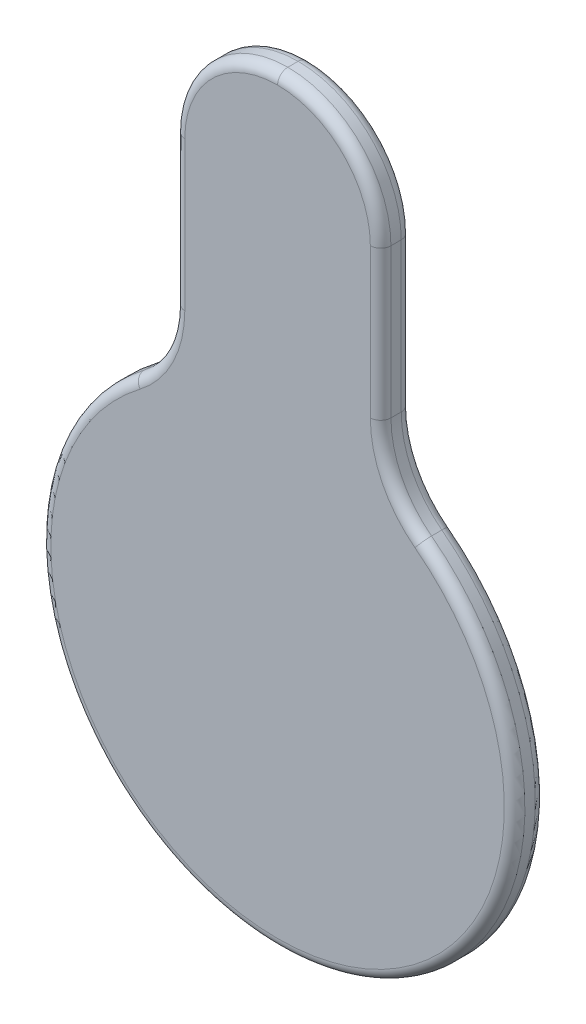
ISO-10303-21;
HEADER;
FILE_DESCRIPTION(('STEP AP214'),'2;1');
FILE_NAME('part.step','',(''),(''),'','','');
FILE_SCHEMA(('AUTOMOTIVE_DESIGN { 1 0 10303 214 1 1 1 1 }'));
ENDSEC;
DATA;
#1=APPLICATION_CONTEXT('core data for automotive mechanical design processes');
#2=APPLICATION_PROTOCOL_DEFINITION('international standard','automotive_design',2000,#1);
#3=PRODUCT_CONTEXT('',#1,'mechanical');
#4=PRODUCT('Part','Part','',(#3));
#5=PRODUCT_RELATED_PRODUCT_CATEGORY('part','',(#4));
#6=PRODUCT_DEFINITION_FORMATION('','',#4);
#7=PRODUCT_DEFINITION_CONTEXT('part definition',#1,'design');
#8=PRODUCT_DEFINITION('design','',#6,#7);
#9=PRODUCT_DEFINITION_SHAPE('','',#8);
#10=(LENGTH_UNIT() NAMED_UNIT(*) SI_UNIT(.MILLI.,.METRE.));
#11=(NAMED_UNIT(*) PLANE_ANGLE_UNIT() SI_UNIT($,.RADIAN.));
#12=(NAMED_UNIT(*) SI_UNIT($,.STERADIAN.) SOLID_ANGLE_UNIT());
#13=UNCERTAINTY_MEASURE_WITH_UNIT(LENGTH_MEASURE(1.E-05),#10,'distance_accuracy_value','');
#14=(GEOMETRIC_REPRESENTATION_CONTEXT(3) GLOBAL_UNCERTAINTY_ASSIGNED_CONTEXT((#13)) GLOBAL_UNIT_ASSIGNED_CONTEXT((#10,
#11,#12)) REPRESENTATION_CONTEXT('',''));
#15=CARTESIAN_POINT('',(0.,0.,0.));
#16=DIRECTION('',(0.,0.,1.));
#17=DIRECTION('',(1.,0.,0.));
#18=AXIS2_PLACEMENT_3D('',#15,#16,#17);
#19=CARTESIAN_POINT('',(0.,0.,7.62));
#20=DIRECTION('',(0.,0.,-1.));
#21=DIRECTION('',(-1.,0.,0.));
#22=AXIS2_PLACEMENT_3D('',#19,#20,#21);
#23=CYLINDRICAL_SURFACE('',#22,58.42);
#24=DIRECTION('',(0.,0.,-1.));
#25=VECTOR('',#24,1.);
#26=CARTESIAN_POINT('',(-35.4060606060606,46.4683469940557,7.62));
#27=LINE('',#26,#25);
#28=CARTESIAN_POINT('',(-35.4060606060606,46.4683469940557,5.08));
#29=VERTEX_POINT('',#28);
#30=CARTESIAN_POINT('',(-35.4060606060606,46.4683469940557,2.54));
#31=VERTEX_POINT('',#30);
#32=EDGE_CURVE('E320',#29,#31,#27,.T.);
#33=ORIENTED_EDGE('',*,*,#32,.T.);
#34=CARTESIAN_POINT('',(0.,0.,2.54));
#35=DIRECTION('',(0.,0.,1.));
#36=DIRECTION('',(1.,0.,0.));
#37=AXIS2_PLACEMENT_3D('',#34,#35,#36);
#38=CIRCLE('',#37,58.42);
#39=CARTESIAN_POINT('',(35.4060606060606,46.4683469940557,2.54));
#40=VERTEX_POINT('',#39);
#41=EDGE_CURVE('E11',#31,#40,#38,.T.);
#42=ORIENTED_EDGE('',*,*,#41,.T.);
#43=DIRECTION('',(0.,0.,-1.));
#44=VECTOR('',#43,1.);
#45=CARTESIAN_POINT('',(35.4060606060606,46.4683469940557,7.62));
#46=LINE('',#45,#44);
#47=CARTESIAN_POINT('',(35.4060606060606,46.4683469940557,5.08));
#48=VERTEX_POINT('',#47);
#49=EDGE_CURVE('E176',#40,#48,#46,.F.);
#50=ORIENTED_EDGE('',*,*,#49,.T.);
#51=CARTESIAN_POINT('',(0.,0.,5.08));
#52=DIRECTION('',(0.,0.,1.));
#53=DIRECTION('',(1.,0.,0.));
#54=AXIS2_PLACEMENT_3D('',#51,#52,#53);
#55=CIRCLE('',#54,58.42);
#56=EDGE_CURVE('E51',#48,#29,#55,.F.);
#57=ORIENTED_EDGE('',*,*,#56,.T.);
#58=EDGE_LOOP('',(#33,#42,#50,#57));
#59=FACE_BOUND('',#58,.T.);
#60=ADVANCED_FACE('F41',(#59),#23,.T.);
#61=CARTESIAN_POINT('',(25.4,0.,7.62));
#62=DIRECTION('',(1.,0.,0.));
#63=DIRECTION('',(0.,1.,0.));
#64=AXIS2_PLACEMENT_3D('',#61,#62,#63);
#65=PLANE('',#64);
#66=DIRECTION('',(0.,0.,-1.));
#67=VECTOR('',#66,1.);
#68=CARTESIAN_POINT('',(25.4,66.671976121906,7.62));
#69=LINE('',#68,#67);
#70=CARTESIAN_POINT('',(25.4,66.671976121906,5.08));
#71=VERTEX_POINT('',#70);
#72=CARTESIAN_POINT('',(25.4,66.671976121906,2.54));
#73=VERTEX_POINT('',#72);
#74=EDGE_CURVE('E328',#71,#73,#69,.T.);
#75=ORIENTED_EDGE('',*,*,#74,.T.);
#76=DIRECTION('',(0.,-1.,0.));
#77=VECTOR('',#76,1.);
#78=CARTESIAN_POINT('',(25.4,103.409280550108,2.54));
#79=LINE('',#78,#77);
#80=CARTESIAN_POINT('',(25.4,103.409280550108,2.54));
#81=VERTEX_POINT('',#80);
#82=EDGE_CURVE('E223',#73,#81,#79,.F.);
#83=ORIENTED_EDGE('',*,*,#82,.T.);
#84=DIRECTION('',(0.,0.,-1.));
#85=VECTOR('',#84,1.);
#86=CARTESIAN_POINT('',(25.4,103.409280550108,7.62));
#87=LINE('',#86,#85);
#88=CARTESIAN_POINT('',(25.4,103.409280550108,5.08));
#89=VERTEX_POINT('',#88);
#90=EDGE_CURVE('E348',#81,#89,#87,.F.);
#91=ORIENTED_EDGE('',*,*,#90,.T.);
#92=DIRECTION('',(0.,-1.,0.));
#93=VECTOR('',#92,1.);
#94=CARTESIAN_POINT('',(25.4,0.,5.08));
#95=LINE('',#94,#93);
#96=EDGE_CURVE('E220',#89,#71,#95,.T.);
#97=ORIENTED_EDGE('',*,*,#96,.T.);
#98=EDGE_LOOP('',(#75,#83,#91,#97));
#99=FACE_BOUND('',#98,.T.);
#100=ADVANCED_FACE('F359',(#99),#65,.T.);
#101=CARTESIAN_POINT('',(-25.4,0.,7.62));
#102=DIRECTION('',(1.,0.,0.));
#103=DIRECTION('',(0.,1.,0.));
#104=AXIS2_PLACEMENT_3D('',#101,#102,#103);
#105=PLANE('',#104);
#106=DIRECTION('',(0.,0.,-1.));
#107=VECTOR('',#106,1.);
#108=CARTESIAN_POINT('',(-25.4,103.409280550108,7.62));
#109=LINE('',#108,#107);
#110=CARTESIAN_POINT('',(-25.4,103.409280550108,5.08));
#111=VERTEX_POINT('',#110);
#112=CARTESIAN_POINT('',(-25.4,103.409280550108,2.54));
#113=VERTEX_POINT('',#112);
#114=EDGE_CURVE('E340',#111,#113,#109,.T.);
#115=ORIENTED_EDGE('',*,*,#114,.T.);
#116=DIRECTION('',(0.,-1.,0.));
#117=VECTOR('',#116,1.);
#118=CARTESIAN_POINT('',(-25.4,0.,2.54));
#119=LINE('',#118,#117);
#120=CARTESIAN_POINT('',(-25.4,66.671976121906,2.54));
#121=VERTEX_POINT('',#120);
#122=EDGE_CURVE('E205',#113,#121,#119,.T.);
#123=ORIENTED_EDGE('',*,*,#122,.T.);
#124=DIRECTION('',(0.,0.,1.));
#125=VECTOR('',#124,1.);
#126=CARTESIAN_POINT('',(-25.4,66.671976121906,7.62));
#127=LINE('',#126,#125);
#128=CARTESIAN_POINT('',(-25.4,66.671976121906,5.08));
#129=VERTEX_POINT('',#128);
#130=EDGE_CURVE('E172',#121,#129,#127,.T.);
#131=ORIENTED_EDGE('',*,*,#130,.T.);
#132=DIRECTION('',(0.,-1.,0.));
#133=VECTOR('',#132,1.);
#134=CARTESIAN_POINT('',(-25.4,103.409280550108,5.08));
#135=LINE('',#134,#133);
#136=EDGE_CURVE('E202',#129,#111,#135,.F.);
#137=ORIENTED_EDGE('',*,*,#136,.T.);
#138=EDGE_LOOP('',(#115,#123,#131,#137));
#139=FACE_BOUND('',#138,.T.);
#140=ADVANCED_FACE('F339',(#139),#105,.F.);
#141=CARTESIAN_POINT('',(0.,0.,7.62));
#142=DIRECTION('',(0.,0.,1.));
#143=DIRECTION('',(1.,0.,0.));
#144=AXIS2_PLACEMENT_3D('',#141,#142,#143);
#145=PLANE('',#144);
#146=DIRECTION('',(0.,-1.,0.));
#147=VECTOR('',#146,1.);
#148=CARTESIAN_POINT('',(-22.86,66.671976121906,7.62));
#149=LINE('',#148,#147);
#150=CARTESIAN_POINT('',(-22.86,103.409280550108,7.62));
#151=VERTEX_POINT('',#150);
#152=CARTESIAN_POINT('',(-22.86,66.671976121906,7.62));
#153=VERTEX_POINT('',#152);
#154=EDGE_CURVE('E59',#151,#153,#149,.T.);
#155=ORIENTED_EDGE('',*,*,#154,.T.);
#156=CARTESIAN_POINT('',(-50.8,66.671976121906,7.62));
#157=DIRECTION('',(0.,0.,1.));
#158=DIRECTION('',(1.,0.,0.));
#159=AXIS2_PLACEMENT_3D('',#156,#157,#158);
#160=CIRCLE('',#159,27.94);
#161=CARTESIAN_POINT('',(-33.8666666666667,44.4479840812706,7.62));
#162=VERTEX_POINT('',#161);
#163=EDGE_CURVE('E247',#153,#162,#160,.F.);
#164=ORIENTED_EDGE('',*,*,#163,.T.);
#165=CARTESIAN_POINT('',(0.,0.,7.62));
#166=DIRECTION('',(0.,0.,1.));
#167=DIRECTION('',(1.,0.,0.));
#168=AXIS2_PLACEMENT_3D('',#165,#166,#167);
#169=CIRCLE('',#168,55.88);
#170=CARTESIAN_POINT('',(33.8666666666667,44.4479840812706,7.62));
#171=VERTEX_POINT('',#170);
#172=EDGE_CURVE('E231',#162,#171,#169,.T.);
#173=ORIENTED_EDGE('',*,*,#172,.T.);
#174=CARTESIAN_POINT('',(50.8,66.671976121906,7.62));
#175=DIRECTION('',(0.,0.,1.));
#176=DIRECTION('',(1.,0.,0.));
#177=AXIS2_PLACEMENT_3D('',#174,#175,#176);
#178=CIRCLE('',#177,27.94);
#179=CARTESIAN_POINT('',(22.86,66.671976121906,7.62));
#180=VERTEX_POINT('',#179);
#181=EDGE_CURVE('E234',#171,#180,#178,.F.);
#182=ORIENTED_EDGE('',*,*,#181,.T.);
#183=DIRECTION('',(0.,-1.,0.));
#184=VECTOR('',#183,1.);
#185=CARTESIAN_POINT('',(22.86,0.,7.62));
#186=LINE('',#185,#184);
#187=CARTESIAN_POINT('',(22.86,103.409280550108,7.62));
#188=VERTEX_POINT('',#187);
#189=EDGE_CURVE('E237',#180,#188,#186,.F.);
#190=ORIENTED_EDGE('',*,*,#189,.T.);
#191=CARTESIAN_POINT('',(0.,103.409280550108,7.62));
#192=DIRECTION('',(0.,0.,1.));
#193=DIRECTION('',(1.,0.,0.));
#194=AXIS2_PLACEMENT_3D('',#191,#192,#193);
#195=CIRCLE('',#194,22.86);
#196=CARTESIAN_POINT('',(0.,126.269280550108,7.62));
#197=VERTEX_POINT('',#196);
#198=EDGE_CURVE('E240',#188,#197,#195,.T.);
#199=ORIENTED_EDGE('',*,*,#198,.T.);
#200=CARTESIAN_POINT('',(0.,103.409280550108,7.62));
#201=DIRECTION('',(0.,0.,1.));
#202=DIRECTION('',(1.,0.,0.));
#203=AXIS2_PLACEMENT_3D('',#200,#201,#202);
#204=CIRCLE('',#203,22.86);
#205=EDGE_CURVE('E64',#197,#151,#204,.T.);
#206=ORIENTED_EDGE('',*,*,#205,.T.);
#207=EDGE_LOOP('',(#155,#164,#173,#182,#190,#199,#206));
#208=FACE_BOUND('',#207,.T.);
#209=ADVANCED_FACE('F305',(#208),#145,.T.);
#210=CARTESIAN_POINT('',(0.,0.,0.));
#211=DIRECTION('',(0.,0.,1.));
#212=DIRECTION('',(1.,0.,0.));
#213=AXIS2_PLACEMENT_3D('',#210,#211,#212);
#214=PLANE('',#213);
#215=CARTESIAN_POINT('',(0.,0.,0.));
#216=DIRECTION('',(0.,0.,1.));
#217=DIRECTION('',(1.,0.,0.));
#218=AXIS2_PLACEMENT_3D('',#215,#216,#217);
#219=CIRCLE('',#218,55.88);
#220=CARTESIAN_POINT('',(33.8666666666667,44.4479840812706,0.));
#221=VERTEX_POINT('',#220);
#222=CARTESIAN_POINT('',(-33.8666666666667,44.4479840812706,0.));
#223=VERTEX_POINT('',#222);
#224=EDGE_CURVE('E148',#221,#223,#219,.F.);
#225=ORIENTED_EDGE('',*,*,#224,.T.);
#226=CARTESIAN_POINT('',(-50.8,66.671976121906,0.));
#227=DIRECTION('',(0.,0.,1.));
#228=DIRECTION('',(1.,0.,0.));
#229=AXIS2_PLACEMENT_3D('',#226,#227,#228);
#230=CIRCLE('',#229,27.94);
#231=CARTESIAN_POINT('',(-22.86,66.671976121906,0.));
#232=VERTEX_POINT('',#231);
#233=EDGE_CURVE('E191',#223,#232,#230,.T.);
#234=ORIENTED_EDGE('',*,*,#233,.T.);
#235=DIRECTION('',(0.,-1.,0.));
#236=VECTOR('',#235,1.);
#237=CARTESIAN_POINT('',(-22.86,0.,0.));
#238=LINE('',#237,#236);
#239=CARTESIAN_POINT('',(-22.86,103.409280550108,0.));
#240=VERTEX_POINT('',#239);
#241=EDGE_CURVE('E188',#232,#240,#238,.F.);
#242=ORIENTED_EDGE('',*,*,#241,.T.);
#243=CARTESIAN_POINT('',(0.,103.409280550108,0.));
#244=DIRECTION('',(0.,0.,1.));
#245=DIRECTION('',(1.,0.,0.));
#246=AXIS2_PLACEMENT_3D('',#243,#244,#245);
#247=CIRCLE('',#246,22.86);
#248=CARTESIAN_POINT('',(0.,126.269280550108,0.));
#249=VERTEX_POINT('',#248);
#250=EDGE_CURVE('E185',#240,#249,#247,.F.);
#251=ORIENTED_EDGE('',*,*,#250,.T.);
#252=CARTESIAN_POINT('',(0.,103.409280550108,0.));
#253=DIRECTION('',(0.,0.,1.));
#254=DIRECTION('',(1.,0.,0.));
#255=AXIS2_PLACEMENT_3D('',#252,#253,#254);
#256=CIRCLE('',#255,22.86);
#257=CARTESIAN_POINT('',(22.86,103.409280550108,0.));
#258=VERTEX_POINT('',#257);
#259=EDGE_CURVE('E182',#249,#258,#256,.F.);
#260=ORIENTED_EDGE('',*,*,#259,.T.);
#261=DIRECTION('',(0.,-1.,0.));
#262=VECTOR('',#261,1.);
#263=CARTESIAN_POINT('',(22.86,66.671976121906,0.));
#264=LINE('',#263,#262);
#265=CARTESIAN_POINT('',(22.86,66.671976121906,0.));
#266=VERTEX_POINT('',#265);
#267=EDGE_CURVE('E151',#258,#266,#264,.T.);
#268=ORIENTED_EDGE('',*,*,#267,.T.);
#269=CARTESIAN_POINT('',(50.8,66.671976121906,0.));
#270=DIRECTION('',(0.,0.,1.));
#271=DIRECTION('',(1.,0.,0.));
#272=AXIS2_PLACEMENT_3D('',#269,#270,#271);
#273=CIRCLE('',#272,27.94);
#274=EDGE_CURVE('E143',#266,#221,#273,.T.);
#275=ORIENTED_EDGE('',*,*,#274,.T.);
#276=EDGE_LOOP('',(#225,#234,#242,#251,#260,#268,#275));
#277=FACE_BOUND('',#276,.T.);
#278=ADVANCED_FACE('F145',(#277),#214,.F.);
#279=CARTESIAN_POINT('',(0.,103.409280550108,7.62));
#280=DIRECTION('',(0.,0.,1.));
#281=DIRECTION('',(1.,0.,0.));
#282=AXIS2_PLACEMENT_3D('',#279,#280,#281);
#283=CYLINDRICAL_SURFACE('',#282,25.4);
#284=ORIENTED_EDGE('',*,*,#90,.F.);
#285=CARTESIAN_POINT('',(0.,103.409280550108,2.54));
#286=DIRECTION('',(0.,0.,1.));
#287=DIRECTION('',(1.,0.,0.));
#288=AXIS2_PLACEMENT_3D('',#285,#286,#287);
#289=CIRCLE('',#288,25.4);
#290=CARTESIAN_POINT('',(0.,128.809280550108,2.54));
#291=VERTEX_POINT('',#290);
#292=EDGE_CURVE('E217',#81,#291,#289,.T.);
#293=ORIENTED_EDGE('',*,*,#292,.T.);
#294=DIRECTION('',(0.,0.,-1.));
#295=VECTOR('',#294,1.);
#296=CARTESIAN_POINT('',(0.,128.809280550108,0.));
#297=LINE('',#296,#295);
#298=CARTESIAN_POINT('',(0.,128.809280550108,5.08));
#299=VERTEX_POINT('',#298);
#300=EDGE_CURVE('E270',#299,#291,#297,.T.);
#301=ORIENTED_EDGE('',*,*,#300,.F.);
#302=CARTESIAN_POINT('',(0.,103.409280550108,5.08));
#303=DIRECTION('',(0.,0.,1.));
#304=DIRECTION('',(1.,0.,0.));
#305=AXIS2_PLACEMENT_3D('',#302,#303,#304);
#306=CIRCLE('',#305,25.4);
#307=EDGE_CURVE('E214',#299,#89,#306,.F.);
#308=ORIENTED_EDGE('',*,*,#307,.T.);
#309=EDGE_LOOP('',(#284,#293,#301,#308));
#310=FACE_BOUND('',#309,.T.);
#311=ADVANCED_FACE('F371',(#310),#283,.T.);
#312=CARTESIAN_POINT('',(0.,103.409280550108,7.62));
#313=DIRECTION('',(0.,0.,-1.));
#314=DIRECTION('',(-1.,0.,0.));
#315=AXIS2_PLACEMENT_3D('',#312,#313,#314);
#316=CYLINDRICAL_SURFACE('',#315,25.4);
#317=ORIENTED_EDGE('',*,*,#300,.T.);
#318=CARTESIAN_POINT('',(0.,103.409280550108,2.54));
#319=DIRECTION('',(0.,0.,1.));
#320=DIRECTION('',(1.,0.,0.));
#321=AXIS2_PLACEMENT_3D('',#318,#319,#320);
#322=CIRCLE('',#321,25.4);
#323=EDGE_CURVE('E211',#291,#113,#322,.T.);
#324=ORIENTED_EDGE('',*,*,#323,.T.);
#325=ORIENTED_EDGE('',*,*,#114,.F.);
#326=CARTESIAN_POINT('',(0.,103.409280550108,5.08));
#327=DIRECTION('',(0.,0.,1.));
#328=DIRECTION('',(1.,0.,0.));
#329=AXIS2_PLACEMENT_3D('',#326,#327,#328);
#330=CIRCLE('',#329,25.4);
#331=EDGE_CURVE('E208',#111,#299,#330,.F.);
#332=ORIENTED_EDGE('',*,*,#331,.T.);
#333=EDGE_LOOP('',(#317,#324,#325,#332));
#334=FACE_BOUND('',#333,.T.);
#335=ADVANCED_FACE('F344',(#334),#316,.T.);
#336=CARTESIAN_POINT('',(50.8,66.671976121906,7.62));
#337=DIRECTION('',(0.,0.,-1.));
#338=DIRECTION('',(-1.,0.,0.));
#339=AXIS2_PLACEMENT_3D('',#336,#337,#338);
#340=CYLINDRICAL_SURFACE('',#339,25.4);
#341=ORIENTED_EDGE('',*,*,#49,.F.);
#342=CARTESIAN_POINT('',(50.8,66.671976121906,2.54));
#343=DIRECTION('',(0.,0.,1.));
#344=DIRECTION('',(1.,0.,0.));
#345=AXIS2_PLACEMENT_3D('',#342,#343,#344);
#346=CIRCLE('',#345,25.4);
#347=EDGE_CURVE('E161',#40,#73,#346,.F.);
#348=ORIENTED_EDGE('',*,*,#347,.T.);
#349=ORIENTED_EDGE('',*,*,#74,.F.);
#350=CARTESIAN_POINT('',(50.8,66.671976121906,5.08));
#351=DIRECTION('',(0.,0.,1.));
#352=DIRECTION('',(1.,0.,0.));
#353=AXIS2_PLACEMENT_3D('',#350,#351,#352);
#354=CIRCLE('',#353,25.4);
#355=EDGE_CURVE('E226',#71,#48,#354,.T.);
#356=ORIENTED_EDGE('',*,*,#355,.T.);
#357=EDGE_LOOP('',(#341,#348,#349,#356));
#358=FACE_BOUND('',#357,.T.);
#359=ADVANCED_FACE('F370',(#358),#340,.F.);
#360=CARTESIAN_POINT('',(-50.8,66.671976121906,7.62));
#361=DIRECTION('',(0.,0.,-1.));
#362=DIRECTION('',(-1.,0.,0.));
#363=AXIS2_PLACEMENT_3D('',#360,#361,#362);
#364=CYLINDRICAL_SURFACE('',#363,25.4);
#365=ORIENTED_EDGE('',*,*,#130,.F.);
#366=CARTESIAN_POINT('',(-50.8,66.671976121906,2.54));
#367=DIRECTION('',(0.,0.,1.));
#368=DIRECTION('',(1.,0.,0.));
#369=AXIS2_PLACEMENT_3D('',#366,#367,#368);
#370=CIRCLE('',#369,25.4);
#371=EDGE_CURVE('E198',#121,#31,#370,.F.);
#372=ORIENTED_EDGE('',*,*,#371,.T.);
#373=ORIENTED_EDGE('',*,*,#32,.F.);
#374=CARTESIAN_POINT('',(-50.8,66.671976121906,5.08));
#375=DIRECTION('',(0.,0.,1.));
#376=DIRECTION('',(1.,0.,0.));
#377=AXIS2_PLACEMENT_3D('',#374,#375,#376);
#378=CIRCLE('',#377,25.4);
#379=EDGE_CURVE('E194',#29,#129,#378,.T.);
#380=ORIENTED_EDGE('',*,*,#379,.T.);
#381=EDGE_LOOP('',(#365,#372,#373,#380));
#382=FACE_BOUND('',#381,.T.);
#383=ADVANCED_FACE('F325',(#382),#364,.F.);
#384=CARTESIAN_POINT('',(22.86,0.,2.54));
#385=DIRECTION('',(0.,1.,0.));
#386=DIRECTION('',(-1.,0.,0.));
#387=AXIS2_PLACEMENT_3D('',#384,#385,#386);
#388=CYLINDRICAL_SURFACE('',#387,2.54);
#389=CARTESIAN_POINT('',(22.86,66.671976121906,2.54));
#390=DIRECTION('',(0.,-1.,0.));
#391=DIRECTION('',(0.,0.,-1.));
#392=AXIS2_PLACEMENT_3D('',#389,#390,#391);
#393=CIRCLE('',#392,2.54);
#394=EDGE_CURVE('E263',#266,#73,#393,.T.);
#395=ORIENTED_EDGE('',*,*,#394,.F.);
#396=ORIENTED_EDGE('',*,*,#267,.F.);
#397=CARTESIAN_POINT('',(22.86,103.409280550108,2.54));
#398=DIRECTION('',(0.,1.,0.));
#399=DIRECTION('',(0.,0.,1.));
#400=AXIS2_PLACEMENT_3D('',#397,#398,#399);
#401=CIRCLE('',#400,2.54);
#402=EDGE_CURVE('E266',#81,#258,#401,.T.);
#403=ORIENTED_EDGE('',*,*,#402,.F.);
#404=ORIENTED_EDGE('',*,*,#82,.F.);
#405=EDGE_LOOP('',(#395,#396,#403,#404));
#406=FACE_BOUND('',#405,.T.);
#407=ADVANCED_FACE('F380',(#406),#388,.T.);
#408=CARTESIAN_POINT('',(0.,103.409280550108,2.54));
#409=DIRECTION('',(0.,0.,1.));
#410=DIRECTION('',(1.,0.,0.));
#411=AXIS2_PLACEMENT_3D('',#408,#409,#410);
#412=TOROIDAL_SURFACE('',#411,22.86,2.54);
#413=ORIENTED_EDGE('',*,*,#402,.T.);
#414=ORIENTED_EDGE('',*,*,#259,.F.);
#415=CARTESIAN_POINT('',(0.,126.269280550108,2.54));
#416=DIRECTION('',(-1.,0.,0.));
#417=DIRECTION('',(0.,0.,1.));
#418=AXIS2_PLACEMENT_3D('',#415,#416,#417);
#419=CIRCLE('',#418,2.54);
#420=EDGE_CURVE('E165',#291,#249,#419,.T.);
#421=ORIENTED_EDGE('',*,*,#420,.F.);
#422=ORIENTED_EDGE('',*,*,#292,.F.);
#423=EDGE_LOOP('',(#413,#414,#421,#422));
#424=FACE_BOUND('',#423,.T.);
#425=ADVANCED_FACE('F397',(#424),#412,.T.);
#426=CARTESIAN_POINT('',(50.8,66.671976121906,2.54));
#427=DIRECTION('',(0.,0.,1.));
#428=DIRECTION('',(1.,0.,0.));
#429=AXIS2_PLACEMENT_3D('',#426,#427,#428);
#430=TOROIDAL_SURFACE('',#429,27.94,2.54);
#431=ORIENTED_EDGE('',*,*,#394,.T.);
#432=ORIENTED_EDGE('',*,*,#347,.F.);
#433=CARTESIAN_POINT('',(33.8666666666667,44.4479840812706,2.54));
#434=DIRECTION('',(0.795418469600406,-0.606060606060605,0.));
#435=DIRECTION('',(0.606060606060605,0.795418469600406,0.));
#436=AXIS2_PLACEMENT_3D('',#433,#434,#435);
#437=CIRCLE('',#436,2.54);
#438=EDGE_CURVE('E159',#221,#40,#437,.T.);
#439=ORIENTED_EDGE('',*,*,#438,.F.);
#440=ORIENTED_EDGE('',*,*,#274,.F.);
#441=EDGE_LOOP('',(#431,#432,#439,#440));
#442=FACE_BOUND('',#441,.T.);
#443=ADVANCED_FACE('F160',(#442),#430,.T.);
#444=CARTESIAN_POINT('',(0.,103.409280550108,2.54));
#445=DIRECTION('',(0.,0.,1.));
#446=DIRECTION('',(1.,0.,0.));
#447=AXIS2_PLACEMENT_3D('',#444,#445,#446);
#448=TOROIDAL_SURFACE('',#447,22.86,2.54);
#449=ORIENTED_EDGE('',*,*,#420,.T.);
#450=ORIENTED_EDGE('',*,*,#250,.F.);
#451=CARTESIAN_POINT('',(-22.86,103.409280550108,2.54));
#452=DIRECTION('',(0.,-1.,0.));
#453=DIRECTION('',(0.,0.,-1.));
#454=AXIS2_PLACEMENT_3D('',#451,#452,#453);
#455=CIRCLE('',#454,2.54);
#456=EDGE_CURVE('E166',#113,#240,#455,.T.);
#457=ORIENTED_EDGE('',*,*,#456,.F.);
#458=ORIENTED_EDGE('',*,*,#323,.F.);
#459=EDGE_LOOP('',(#449,#450,#457,#458));
#460=FACE_BOUND('',#459,.T.);
#461=ADVANCED_FACE('F391',(#460),#448,.T.);
#462=CARTESIAN_POINT('',(0.,0.,2.54));
#463=DIRECTION('',(0.,0.,1.));
#464=DIRECTION('',(1.,0.,0.));
#465=AXIS2_PLACEMENT_3D('',#462,#463,#464);
#466=TOROIDAL_SURFACE('',#465,55.88,2.54);
#467=ORIENTED_EDGE('',*,*,#438,.T.);
#468=ORIENTED_EDGE('',*,*,#41,.F.);
#469=CARTESIAN_POINT('',(-33.8666666666667,44.4479840812706,2.54));
#470=DIRECTION('',(0.795418469600407,0.606060606060604,0.));
#471=DIRECTION('',(-0.606060606060604,0.795418469600407,0.));
#472=AXIS2_PLACEMENT_3D('',#469,#470,#471);
#473=CIRCLE('',#472,2.54);
#474=EDGE_CURVE('E169',#223,#31,#473,.T.);
#475=ORIENTED_EDGE('',*,*,#474,.F.);
#476=ORIENTED_EDGE('',*,*,#224,.F.);
#477=EDGE_LOOP('',(#467,#468,#475,#476));
#478=FACE_BOUND('',#477,.T.);
#479=ADVANCED_FACE('F168',(#478),#466,.T.);
#480=CARTESIAN_POINT('',(-22.86,0.,2.54));
#481=DIRECTION('',(0.,-1.,0.));
#482=DIRECTION('',(1.,0.,0.));
#483=AXIS2_PLACEMENT_3D('',#480,#481,#482);
#484=CYLINDRICAL_SURFACE('',#483,2.54);
#485=ORIENTED_EDGE('',*,*,#456,.T.);
#486=ORIENTED_EDGE('',*,*,#241,.F.);
#487=CARTESIAN_POINT('',(-22.86,66.671976121906,2.54));
#488=DIRECTION('',(0.,-1.,0.));
#489=DIRECTION('',(0.,0.,-1.));
#490=AXIS2_PLACEMENT_3D('',#487,#488,#489);
#491=CIRCLE('',#490,2.54);
#492=EDGE_CURVE('E252',#121,#232,#491,.T.);
#493=ORIENTED_EDGE('',*,*,#492,.F.);
#494=ORIENTED_EDGE('',*,*,#122,.F.);
#495=EDGE_LOOP('',(#485,#486,#493,#494));
#496=FACE_BOUND('',#495,.T.);
#497=ADVANCED_FACE('F384',(#496),#484,.T.);
#498=CARTESIAN_POINT('',(-50.8,66.671976121906,2.54));
#499=DIRECTION('',(0.,0.,1.));
#500=DIRECTION('',(1.,0.,0.));
#501=AXIS2_PLACEMENT_3D('',#498,#499,#500);
#502=TOROIDAL_SURFACE('',#501,27.94,2.54);
#503=ORIENTED_EDGE('',*,*,#474,.T.);
#504=ORIENTED_EDGE('',*,*,#371,.F.);
#505=ORIENTED_EDGE('',*,*,#492,.T.);
#506=ORIENTED_EDGE('',*,*,#233,.F.);
#507=EDGE_LOOP('',(#503,#504,#505,#506));
#508=FACE_BOUND('',#507,.T.);
#509=ADVANCED_FACE('F381',(#508),#502,.T.);
#510=CARTESIAN_POINT('',(0.,103.409280550108,5.08));
#511=DIRECTION('',(0.,0.,1.));
#512=DIRECTION('',(1.,0.,0.));
#513=AXIS2_PLACEMENT_3D('',#510,#511,#512);
#514=TOROIDAL_SURFACE('',#513,22.86,2.54);
#515=CARTESIAN_POINT('',(0.,126.269280550108,5.08));
#516=DIRECTION('',(-1.,0.,0.));
#517=DIRECTION('',(0.,-1.,0.));
#518=AXIS2_PLACEMENT_3D('',#515,#516,#517);
#519=CIRCLE('',#518,2.54);
#520=EDGE_CURVE('E288',#197,#299,#519,.T.);
#521=ORIENTED_EDGE('',*,*,#520,.F.);
#522=ORIENTED_EDGE('',*,*,#198,.F.);
#523=CARTESIAN_POINT('',(22.86,103.409280550108,5.08));
#524=DIRECTION('',(0.,-1.,0.));
#525=DIRECTION('',(0.,0.,-1.));
#526=AXIS2_PLACEMENT_3D('',#523,#524,#525);
#527=CIRCLE('',#526,2.54);
#528=EDGE_CURVE('E45',#89,#188,#527,.T.);
#529=ORIENTED_EDGE('',*,*,#528,.F.);
#530=ORIENTED_EDGE('',*,*,#307,.F.);
#531=EDGE_LOOP('',(#521,#522,#529,#530));
#532=FACE_BOUND('',#531,.T.);
#533=ADVANCED_FACE('F43',(#532),#514,.T.);
#534=CARTESIAN_POINT('',(22.86,0.,5.08));
#535=DIRECTION('',(0.,-1.,0.));
#536=DIRECTION('',(1.,0.,0.));
#537=AXIS2_PLACEMENT_3D('',#534,#535,#536);
#538=CYLINDRICAL_SURFACE('',#537,2.54);
#539=ORIENTED_EDGE('',*,*,#528,.T.);
#540=ORIENTED_EDGE('',*,*,#189,.F.);
#541=CARTESIAN_POINT('',(22.86,66.671976121906,5.08));
#542=DIRECTION('',(0.,-1.,0.));
#543=DIRECTION('',(0.,0.,-1.));
#544=AXIS2_PLACEMENT_3D('',#541,#542,#543);
#545=CIRCLE('',#544,2.54);
#546=EDGE_CURVE('E285',#71,#180,#545,.T.);
#547=ORIENTED_EDGE('',*,*,#546,.F.);
#548=ORIENTED_EDGE('',*,*,#96,.F.);
#549=EDGE_LOOP('',(#539,#540,#547,#548));
#550=FACE_BOUND('',#549,.T.);
#551=ADVANCED_FACE('F300',(#550),#538,.T.);
#552=CARTESIAN_POINT('',(0.,103.409280550108,5.08));
#553=DIRECTION('',(0.,0.,1.));
#554=DIRECTION('',(1.,0.,0.));
#555=AXIS2_PLACEMENT_3D('',#552,#553,#554);
#556=TOROIDAL_SURFACE('',#555,22.86,2.54);
#557=ORIENTED_EDGE('',*,*,#520,.T.);
#558=ORIENTED_EDGE('',*,*,#331,.F.);
#559=CARTESIAN_POINT('',(-22.86,103.409280550108,5.08));
#560=DIRECTION('',(0.,-1.,0.));
#561=DIRECTION('',(0.,0.,-1.));
#562=AXIS2_PLACEMENT_3D('',#559,#560,#561);
#563=CIRCLE('',#562,2.54);
#564=EDGE_CURVE('E281',#151,#111,#563,.T.);
#565=ORIENTED_EDGE('',*,*,#564,.F.);
#566=ORIENTED_EDGE('',*,*,#205,.F.);
#567=EDGE_LOOP('',(#557,#558,#565,#566));
#568=FACE_BOUND('',#567,.T.);
#569=ADVANCED_FACE('F350',(#568),#556,.T.);
#570=CARTESIAN_POINT('',(50.8,66.671976121906,5.08));
#571=DIRECTION('',(0.,0.,1.));
#572=DIRECTION('',(1.,0.,0.));
#573=AXIS2_PLACEMENT_3D('',#570,#571,#572);
#574=TOROIDAL_SURFACE('',#573,27.94,2.54);
#575=ORIENTED_EDGE('',*,*,#546,.T.);
#576=ORIENTED_EDGE('',*,*,#181,.F.);
#577=CARTESIAN_POINT('',(33.8666666666666,44.4479840812706,5.08));
#578=DIRECTION('',(0.795418469600406,-0.606060606060605,0.));
#579=DIRECTION('',(0.606060606060605,0.795418469600406,0.));
#580=AXIS2_PLACEMENT_3D('',#577,#578,#579);
#581=CIRCLE('',#580,2.54);
#582=EDGE_CURVE('E277',#48,#171,#581,.T.);
#583=ORIENTED_EDGE('',*,*,#582,.F.);
#584=ORIENTED_EDGE('',*,*,#355,.F.);
#585=EDGE_LOOP('',(#575,#576,#583,#584));
#586=FACE_BOUND('',#585,.T.);
#587=ADVANCED_FACE('F310',(#586),#574,.T.);
#588=CARTESIAN_POINT('',(-22.86,0.,5.08));
#589=DIRECTION('',(0.,1.,0.));
#590=DIRECTION('',(-1.,0.,0.));
#591=AXIS2_PLACEMENT_3D('',#588,#589,#590);
#592=CYLINDRICAL_SURFACE('',#591,2.54);
#593=ORIENTED_EDGE('',*,*,#564,.T.);
#594=ORIENTED_EDGE('',*,*,#136,.F.);
#595=CARTESIAN_POINT('',(-22.86,66.671976121906,5.08));
#596=DIRECTION('',(0.,-1.,0.));
#597=DIRECTION('',(0.,0.,-1.));
#598=AXIS2_PLACEMENT_3D('',#595,#596,#597);
#599=CIRCLE('',#598,2.54);
#600=EDGE_CURVE('E274',#153,#129,#599,.T.);
#601=ORIENTED_EDGE('',*,*,#600,.F.);
#602=ORIENTED_EDGE('',*,*,#154,.F.);
#603=EDGE_LOOP('',(#593,#594,#601,#602));
#604=FACE_BOUND('',#603,.T.);
#605=ADVANCED_FACE('F335',(#604),#592,.T.);
#606=CARTESIAN_POINT('',(0.,0.,5.08));
#607=DIRECTION('',(0.,0.,1.));
#608=DIRECTION('',(1.,0.,0.));
#609=AXIS2_PLACEMENT_3D('',#606,#607,#608);
#610=TOROIDAL_SURFACE('',#609,55.88,2.54);
#611=ORIENTED_EDGE('',*,*,#582,.T.);
#612=ORIENTED_EDGE('',*,*,#172,.F.);
#613=CARTESIAN_POINT('',(-33.8666666666667,44.4479840812706,5.08));
#614=DIRECTION('',(0.795418469600406,0.606060606060605,0.));
#615=DIRECTION('',(-0.606060606060605,0.795418469600406,0.));
#616=AXIS2_PLACEMENT_3D('',#613,#614,#615);
#617=CIRCLE('',#616,2.54);
#618=EDGE_CURVE('E271',#29,#162,#617,.T.);
#619=ORIENTED_EDGE('',*,*,#618,.F.);
#620=ORIENTED_EDGE('',*,*,#56,.F.);
#621=EDGE_LOOP('',(#611,#612,#619,#620));
#622=FACE_BOUND('',#621,.T.);
#623=ADVANCED_FACE('F314',(#622),#610,.T.);
#624=CARTESIAN_POINT('',(-50.8,66.671976121906,5.08));
#625=DIRECTION('',(0.,0.,1.));
#626=DIRECTION('',(1.,0.,0.));
#627=AXIS2_PLACEMENT_3D('',#624,#625,#626);
#628=TOROIDAL_SURFACE('',#627,27.94,2.54);
#629=ORIENTED_EDGE('',*,*,#600,.T.);
#630=ORIENTED_EDGE('',*,*,#379,.F.);
#631=ORIENTED_EDGE('',*,*,#618,.T.);
#632=ORIENTED_EDGE('',*,*,#163,.F.);
#633=EDGE_LOOP('',(#629,#630,#631,#632));
#634=FACE_BOUND('',#633,.T.);
#635=ADVANCED_FACE('F331',(#634),#628,.T.);
#636=CLOSED_SHELL('',(#60,#100,#140,#209,#278,#311,#335,#359,#383,#407,#425,#443,#461,#479,#497,
#509,#533,#551,#569,#587,#605,#623,#635));
#637=MANIFOLD_SOLID_BREP('B2',#636);
#638=ADVANCED_BREP_SHAPE_REPRESENTATION('',(#18,#637),#14);
#639=SHAPE_DEFINITION_REPRESENTATION(#9,#638);
ENDSEC;
END-ISO-10303-21;
